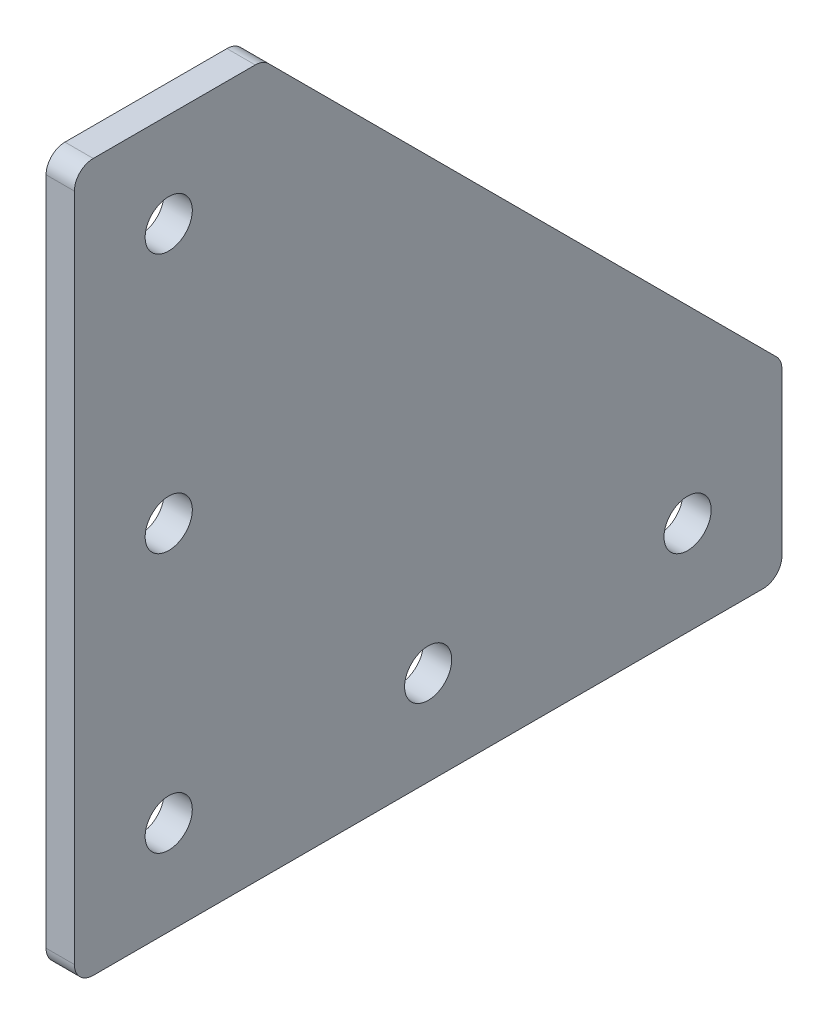
ISO-10303-21;
HEADER;
FILE_DESCRIPTION(('STEP AP214'),'2;1');
FILE_NAME('part.step','',(''),(''),'','','');
FILE_SCHEMA(('AUTOMOTIVE_DESIGN { 1 0 10303 214 1 1 1 1 }'));
ENDSEC;
DATA;
#1=APPLICATION_CONTEXT('core data for automotive mechanical design processes');
#2=APPLICATION_PROTOCOL_DEFINITION('international standard','automotive_design',2000,#1);
#3=PRODUCT_CONTEXT('',#1,'mechanical');
#4=PRODUCT('Part','Part','',(#3));
#5=PRODUCT_RELATED_PRODUCT_CATEGORY('part','',(#4));
#6=PRODUCT_DEFINITION_FORMATION('','',#4);
#7=PRODUCT_DEFINITION_CONTEXT('part definition',#1,'design');
#8=PRODUCT_DEFINITION('design','',#6,#7);
#9=PRODUCT_DEFINITION_SHAPE('','',#8);
#10=(LENGTH_UNIT() NAMED_UNIT(*) SI_UNIT(.MILLI.,.METRE.));
#11=(NAMED_UNIT(*) PLANE_ANGLE_UNIT() SI_UNIT($,.RADIAN.));
#12=(NAMED_UNIT(*) SI_UNIT($,.STERADIAN.) SOLID_ANGLE_UNIT());
#13=UNCERTAINTY_MEASURE_WITH_UNIT(LENGTH_MEASURE(1.E-05),#10,'distance_accuracy_value','');
#14=(GEOMETRIC_REPRESENTATION_CONTEXT(3) GLOBAL_UNCERTAINTY_ASSIGNED_CONTEXT((#13)) GLOBAL_UNIT_ASSIGNED_CONTEXT((#10,
#11,#12)) REPRESENTATION_CONTEXT('',''));
#15=CARTESIAN_POINT('',(0.,0.,0.));
#16=DIRECTION('',(0.,0.,1.));
#17=DIRECTION('',(1.,0.,0.));
#18=AXIS2_PLACEMENT_3D('',#15,#16,#17);
#19=CARTESIAN_POINT('',(3.,0.,0.));
#20=DIRECTION('',(-1.,0.,0.));
#21=DIRECTION('',(0.,0.,1.));
#22=AXIS2_PLACEMENT_3D('',#19,#20,#21);
#23=PLANE('',#22);
#24=DIRECTION('',(0.,-1.,0.));
#25=VECTOR('',#24,1.);
#26=CARTESIAN_POINT('',(3.,0.,0.));
#27=LINE('',#26,#25);
#28=CARTESIAN_POINT('',(3.,73.,0.));
#29=VERTEX_POINT('',#28);
#30=CARTESIAN_POINT('',(3.,2.,0.));
#31=VERTEX_POINT('',#30);
#32=EDGE_CURVE('E198',#29,#31,#27,.T.);
#33=ORIENTED_EDGE('',*,*,#32,.T.);
#34=CARTESIAN_POINT('',(3.,2.,-2.));
#35=DIRECTION('',(-1.,0.,0.));
#36=DIRECTION('',(0.,0.,1.));
#37=AXIS2_PLACEMENT_3D('',#34,#35,#36);
#38=CIRCLE('',#37,2.);
#39=CARTESIAN_POINT('',(3.,0.,-2.));
#40=VERTEX_POINT('',#39);
#41=EDGE_CURVE('E169',#31,#40,#38,.F.);
#42=ORIENTED_EDGE('',*,*,#41,.T.);
#43=DIRECTION('',(0.,0.,-1.));
#44=VECTOR('',#43,1.);
#45=CARTESIAN_POINT('',(3.,0.,-75.));
#46=LINE('',#45,#44);
#47=CARTESIAN_POINT('',(3.,0.,-73.));
#48=VERTEX_POINT('',#47);
#49=EDGE_CURVE('E135',#40,#48,#46,.T.);
#50=ORIENTED_EDGE('',*,*,#49,.T.);
#51=CARTESIAN_POINT('',(3.,2.00000000000001,-73.));
#52=DIRECTION('',(-1.,0.,0.));
#53=DIRECTION('',(0.,0.,1.));
#54=AXIS2_PLACEMENT_3D('',#51,#52,#53);
#55=CIRCLE('',#54,2.);
#56=CARTESIAN_POINT('',(3.,2.00000000000001,-75.));
#57=VERTEX_POINT('',#56);
#58=EDGE_CURVE('E167',#48,#57,#55,.F.);
#59=ORIENTED_EDGE('',*,*,#58,.T.);
#60=DIRECTION('',(0.,1.,0.));
#61=VECTOR('',#60,1.);
#62=CARTESIAN_POINT('',(3.,20.,-75.));
#63=LINE('',#62,#61);
#64=CARTESIAN_POINT('',(3.,19.1715728752538,-75.));
#65=VERTEX_POINT('',#64);
#66=EDGE_CURVE('E142',#57,#65,#63,.T.);
#67=ORIENTED_EDGE('',*,*,#66,.T.);
#68=CARTESIAN_POINT('',(3.,19.1715728752538,-73.));
#69=DIRECTION('',(-1.,0.,0.));
#70=DIRECTION('',(0.,0.,1.));
#71=AXIS2_PLACEMENT_3D('',#68,#69,#70);
#72=CIRCLE('',#71,2.);
#73=CARTESIAN_POINT('',(3.,20.585786437627,-74.4142135623731));
#74=VERTEX_POINT('',#73);
#75=EDGE_CURVE('E165',#65,#74,#72,.F.);
#76=ORIENTED_EDGE('',*,*,#75,.T.);
#77=DIRECTION('',(0.,0.707106781186547,0.707106781186548));
#78=VECTOR('',#77,1.);
#79=CARTESIAN_POINT('',(3.,75.,-20.));
#80=LINE('',#79,#78);
#81=CARTESIAN_POINT('',(3.,74.4142135623731,-20.5857864376269));
#82=VERTEX_POINT('',#81);
#83=EDGE_CURVE('E146',#74,#82,#80,.T.);
#84=ORIENTED_EDGE('',*,*,#83,.T.);
#85=CARTESIAN_POINT('',(3.,73.,-19.1715728752538));
#86=DIRECTION('',(-1.,0.,0.));
#87=DIRECTION('',(0.,0.,1.));
#88=AXIS2_PLACEMENT_3D('',#85,#86,#87);
#89=CIRCLE('',#88,2.);
#90=CARTESIAN_POINT('',(3.,75.,-19.1715728752538));
#91=VERTEX_POINT('',#90);
#92=EDGE_CURVE('E58',#82,#91,#89,.F.);
#93=ORIENTED_EDGE('',*,*,#92,.T.);
#94=DIRECTION('',(0.,0.,1.));
#95=VECTOR('',#94,1.);
#96=CARTESIAN_POINT('',(3.,75.,0.));
#97=LINE('',#96,#95);
#98=CARTESIAN_POINT('',(3.,75.,-2.));
#99=VERTEX_POINT('',#98);
#100=EDGE_CURVE('E201',#91,#99,#97,.T.);
#101=ORIENTED_EDGE('',*,*,#100,.T.);
#102=CARTESIAN_POINT('',(3.,73.,-2.));
#103=DIRECTION('',(-1.,0.,0.));
#104=DIRECTION('',(0.,0.,1.));
#105=AXIS2_PLACEMENT_3D('',#102,#103,#104);
#106=CIRCLE('',#105,2.);
#107=EDGE_CURVE('E162',#99,#29,#106,.F.);
#108=ORIENTED_EDGE('',*,*,#107,.T.);
#109=EDGE_LOOP('',(#33,#42,#50,#59,#67,#76,#84,#93,#101,#108));
#110=FACE_BOUND('',#109,.T.);
#111=CARTESIAN_POINT('',(3.,9.99999999999999,-65.));
#112=DIRECTION('',(1.,0.,0.));
#113=DIRECTION('',(0.,0.,-1.));
#114=AXIS2_PLACEMENT_3D('',#111,#112,#113);
#115=CIRCLE('',#114,2.5);
#116=CARTESIAN_POINT('',(3.,9.99999999999999,-67.5));
#117=VERTEX_POINT('',#116);
#118=EDGE_CURVE('E194',#117,#117,#115,.T.);
#119=ORIENTED_EDGE('',*,*,#118,.F.);
#120=EDGE_LOOP('',(#119));
#121=FACE_BOUND('',#120,.T.);
#122=CARTESIAN_POINT('',(3.,9.99999999999999,-37.5));
#123=DIRECTION('',(1.,0.,0.));
#124=DIRECTION('',(0.,0.,-1.));
#125=AXIS2_PLACEMENT_3D('',#122,#123,#124);
#126=CIRCLE('',#125,2.5);
#127=CARTESIAN_POINT('',(3.,9.99999999999999,-40.));
#128=VERTEX_POINT('',#127);
#129=EDGE_CURVE('E207',#128,#128,#126,.T.);
#130=ORIENTED_EDGE('',*,*,#129,.F.);
#131=EDGE_LOOP('',(#130));
#132=FACE_BOUND('',#131,.T.);
#133=CARTESIAN_POINT('',(3.,9.99999999999999,-9.99999999999999));
#134=DIRECTION('',(1.,0.,0.));
#135=DIRECTION('',(0.,0.,-1.));
#136=AXIS2_PLACEMENT_3D('',#133,#134,#135);
#137=CIRCLE('',#136,2.5);
#138=CARTESIAN_POINT('',(3.,9.99999999999999,-12.5));
#139=VERTEX_POINT('',#138);
#140=EDGE_CURVE('E213',#139,#139,#137,.T.);
#141=ORIENTED_EDGE('',*,*,#140,.F.);
#142=EDGE_LOOP('',(#141));
#143=FACE_BOUND('',#142,.T.);
#144=CARTESIAN_POINT('',(3.,65.,-9.99999999999995));
#145=DIRECTION('',(1.,0.,0.));
#146=DIRECTION('',(0.,0.,1.));
#147=AXIS2_PLACEMENT_3D('',#144,#145,#146);
#148=CIRCLE('',#147,2.5);
#149=CARTESIAN_POINT('',(3.,65.,-7.49999999999996));
#150=VERTEX_POINT('',#149);
#151=EDGE_CURVE('E219',#150,#150,#148,.T.);
#152=ORIENTED_EDGE('',*,*,#151,.F.);
#153=EDGE_LOOP('',(#152));
#154=FACE_BOUND('',#153,.T.);
#155=CARTESIAN_POINT('',(3.,37.5,-9.99999999999997));
#156=DIRECTION('',(1.,0.,0.));
#157=DIRECTION('',(0.,0.,1.));
#158=AXIS2_PLACEMENT_3D('',#155,#156,#157);
#159=CIRCLE('',#158,2.50000000000001);
#160=CARTESIAN_POINT('',(3.,37.5,-7.49999999999996));
#161=VERTEX_POINT('',#160);
#162=EDGE_CURVE('E225',#161,#161,#159,.T.);
#163=ORIENTED_EDGE('',*,*,#162,.F.);
#164=EDGE_LOOP('',(#163));
#165=FACE_BOUND('',#164,.T.);
#166=ADVANCED_FACE('F37',(#110,#121,#132,#143,#154,#165),#23,.F.);
#167=CARTESIAN_POINT('',(0.,0.,0.));
#168=DIRECTION('',(-1.,0.,0.));
#169=DIRECTION('',(0.,0.,1.));
#170=AXIS2_PLACEMENT_3D('',#167,#168,#169);
#171=PLANE('',#170);
#172=CARTESIAN_POINT('',(0.,65.,-9.99999999999995));
#173=DIRECTION('',(1.,0.,0.));
#174=DIRECTION('',(0.,0.,1.));
#175=AXIS2_PLACEMENT_3D('',#172,#173,#174);
#176=CIRCLE('',#175,2.5);
#177=CARTESIAN_POINT('',(0.,65.,-7.49999999999996));
#178=VERTEX_POINT('',#177);
#179=EDGE_CURVE('E222',#178,#178,#176,.T.);
#180=ORIENTED_EDGE('',*,*,#179,.T.);
#181=EDGE_LOOP('',(#180));
#182=FACE_BOUND('',#181,.T.);
#183=CARTESIAN_POINT('',(0.,9.99999999999999,-37.5));
#184=DIRECTION('',(1.,0.,0.));
#185=DIRECTION('',(0.,0.,-1.));
#186=AXIS2_PLACEMENT_3D('',#183,#184,#185);
#187=CIRCLE('',#186,2.5);
#188=CARTESIAN_POINT('',(0.,9.99999999999999,-40.));
#189=VERTEX_POINT('',#188);
#190=EDGE_CURVE('E210',#189,#189,#187,.T.);
#191=ORIENTED_EDGE('',*,*,#190,.T.);
#192=EDGE_LOOP('',(#191));
#193=FACE_BOUND('',#192,.T.);
#194=DIRECTION('',(0.,0.,-1.));
#195=VECTOR('',#194,1.);
#196=CARTESIAN_POINT('',(0.,0.,-75.));
#197=LINE('',#196,#195);
#198=CARTESIAN_POINT('',(0.,0.,-2.));
#199=VERTEX_POINT('',#198);
#200=CARTESIAN_POINT('',(0.,0.,-73.));
#201=VERTEX_POINT('',#200);
#202=EDGE_CURVE('E132',#199,#201,#197,.T.);
#203=ORIENTED_EDGE('',*,*,#202,.F.);
#204=CARTESIAN_POINT('',(0.,2.,-2.));
#205=DIRECTION('',(-1.,0.,0.));
#206=DIRECTION('',(0.,0.,1.));
#207=AXIS2_PLACEMENT_3D('',#204,#205,#206);
#208=CIRCLE('',#207,2.);
#209=CARTESIAN_POINT('',(0.,2.,0.));
#210=VERTEX_POINT('',#209);
#211=EDGE_CURVE('E115',#199,#210,#208,.T.);
#212=ORIENTED_EDGE('',*,*,#211,.T.);
#213=DIRECTION('',(0.,-1.,0.));
#214=VECTOR('',#213,1.);
#215=CARTESIAN_POINT('',(0.,0.,0.));
#216=LINE('',#215,#214);
#217=CARTESIAN_POINT('',(0.,73.,0.));
#218=VERTEX_POINT('',#217);
#219=EDGE_CURVE('E143',#218,#210,#216,.T.);
#220=ORIENTED_EDGE('',*,*,#219,.F.);
#221=CARTESIAN_POINT('',(0.,73.,-2.));
#222=DIRECTION('',(-1.,0.,0.));
#223=DIRECTION('',(0.,0.,1.));
#224=AXIS2_PLACEMENT_3D('',#221,#222,#223);
#225=CIRCLE('',#224,2.);
#226=CARTESIAN_POINT('',(0.,75.,-2.));
#227=VERTEX_POINT('',#226);
#228=EDGE_CURVE('E136',#218,#227,#225,.T.);
#229=ORIENTED_EDGE('',*,*,#228,.T.);
#230=DIRECTION('',(0.,0.,1.));
#231=VECTOR('',#230,1.);
#232=CARTESIAN_POINT('',(0.,75.,0.));
#233=LINE('',#232,#231);
#234=CARTESIAN_POINT('',(0.,75.,-19.1715728752538));
#235=VERTEX_POINT('',#234);
#236=EDGE_CURVE('E148',#235,#227,#233,.T.);
#237=ORIENTED_EDGE('',*,*,#236,.F.);
#238=CARTESIAN_POINT('',(0.,73.,-19.1715728752538));
#239=DIRECTION('',(-1.,0.,0.));
#240=DIRECTION('',(0.,0.,1.));
#241=AXIS2_PLACEMENT_3D('',#238,#239,#240);
#242=CIRCLE('',#241,2.);
#243=CARTESIAN_POINT('',(0.,74.4142135623731,-20.5857864376269));
#244=VERTEX_POINT('',#243);
#245=EDGE_CURVE('E154',#235,#244,#242,.T.);
#246=ORIENTED_EDGE('',*,*,#245,.T.);
#247=DIRECTION('',(0.,0.707106781186547,0.707106781186548));
#248=VECTOR('',#247,1.);
#249=CARTESIAN_POINT('',(0.,75.,-20.));
#250=LINE('',#249,#248);
#251=CARTESIAN_POINT('',(0.,20.585786437627,-74.4142135623731));
#252=VERTEX_POINT('',#251);
#253=EDGE_CURVE('E186',#252,#244,#250,.T.);
#254=ORIENTED_EDGE('',*,*,#253,.F.);
#255=CARTESIAN_POINT('',(0.,19.1715728752538,-73.));
#256=DIRECTION('',(-1.,0.,0.));
#257=DIRECTION('',(0.,0.,1.));
#258=AXIS2_PLACEMENT_3D('',#255,#256,#257);
#259=CIRCLE('',#258,2.);
#260=CARTESIAN_POINT('',(0.,19.1715728752538,-75.));
#261=VERTEX_POINT('',#260);
#262=EDGE_CURVE('E156',#252,#261,#259,.T.);
#263=ORIENTED_EDGE('',*,*,#262,.T.);
#264=DIRECTION('',(0.,1.,0.));
#265=VECTOR('',#264,1.);
#266=CARTESIAN_POINT('',(0.,20.,-75.));
#267=LINE('',#266,#265);
#268=CARTESIAN_POINT('',(0.,2.00000000000001,-75.));
#269=VERTEX_POINT('',#268);
#270=EDGE_CURVE('E192',#269,#261,#267,.T.);
#271=ORIENTED_EDGE('',*,*,#270,.F.);
#272=CARTESIAN_POINT('',(0.,2.00000000000001,-73.));
#273=DIRECTION('',(-1.,0.,0.));
#274=DIRECTION('',(0.,0.,1.));
#275=AXIS2_PLACEMENT_3D('',#272,#273,#274);
#276=CIRCLE('',#275,2.);
#277=EDGE_CURVE('E126',#269,#201,#276,.T.);
#278=ORIENTED_EDGE('',*,*,#277,.T.);
#279=EDGE_LOOP('',(#203,#212,#220,#229,#237,#246,#254,#263,#271,#278));
#280=FACE_BOUND('',#279,.T.);
#281=CARTESIAN_POINT('',(0.,9.99999999999999,-65.));
#282=DIRECTION('',(1.,0.,0.));
#283=DIRECTION('',(0.,0.,-1.));
#284=AXIS2_PLACEMENT_3D('',#281,#282,#283);
#285=CIRCLE('',#284,2.5);
#286=CARTESIAN_POINT('',(0.,9.99999999999999,-67.5));
#287=VERTEX_POINT('',#286);
#288=EDGE_CURVE('E204',#287,#287,#285,.T.);
#289=ORIENTED_EDGE('',*,*,#288,.T.);
#290=EDGE_LOOP('',(#289));
#291=FACE_BOUND('',#290,.T.);
#292=CARTESIAN_POINT('',(0.,9.99999999999999,-9.99999999999999));
#293=DIRECTION('',(1.,0.,0.));
#294=DIRECTION('',(0.,0.,-1.));
#295=AXIS2_PLACEMENT_3D('',#292,#293,#294);
#296=CIRCLE('',#295,2.5);
#297=CARTESIAN_POINT('',(0.,9.99999999999999,-12.5));
#298=VERTEX_POINT('',#297);
#299=EDGE_CURVE('E216',#298,#298,#296,.T.);
#300=ORIENTED_EDGE('',*,*,#299,.T.);
#301=EDGE_LOOP('',(#300));
#302=FACE_BOUND('',#301,.T.);
#303=CARTESIAN_POINT('',(0.,37.5,-9.99999999999997));
#304=DIRECTION('',(1.,0.,0.));
#305=DIRECTION('',(0.,0.,1.));
#306=AXIS2_PLACEMENT_3D('',#303,#304,#305);
#307=CIRCLE('',#306,2.50000000000001);
#308=CARTESIAN_POINT('',(0.,37.5,-7.49999999999996));
#309=VERTEX_POINT('',#308);
#310=EDGE_CURVE('E228',#309,#309,#307,.T.);
#311=ORIENTED_EDGE('',*,*,#310,.T.);
#312=EDGE_LOOP('',(#311));
#313=FACE_BOUND('',#312,.T.);
#314=ADVANCED_FACE('F139',(#182,#193,#280,#291,#302,#313),#171,.T.);
#315=CARTESIAN_POINT('',(3.,20.,-75.));
#316=DIRECTION('',(0.,0.,1.));
#317=DIRECTION('',(1.,0.,0.));
#318=AXIS2_PLACEMENT_3D('',#315,#316,#317);
#319=PLANE('',#318);
#320=ORIENTED_EDGE('',*,*,#66,.F.);
#321=DIRECTION('',(-1.,0.,0.));
#322=VECTOR('',#321,1.);
#323=CARTESIAN_POINT('',(3.,2.00000000000001,-75.));
#324=LINE('',#323,#322);
#325=EDGE_CURVE('E173',#57,#269,#324,.T.);
#326=ORIENTED_EDGE('',*,*,#325,.T.);
#327=ORIENTED_EDGE('',*,*,#270,.T.);
#328=DIRECTION('',(-1.,0.,0.));
#329=VECTOR('',#328,1.);
#330=CARTESIAN_POINT('',(3.,19.1715728752538,-75.));
#331=LINE('',#330,#329);
#332=EDGE_CURVE('E171',#261,#65,#331,.F.);
#333=ORIENTED_EDGE('',*,*,#332,.T.);
#334=EDGE_LOOP('',(#320,#326,#327,#333));
#335=FACE_BOUND('',#334,.T.);
#336=ADVANCED_FACE('F242',(#335),#319,.F.);
#337=CARTESIAN_POINT('',(3.,75.,-20.));
#338=DIRECTION('',(0.,-0.707106781186548,0.707106781186547));
#339=DIRECTION('',(0.,-0.707106781186547,-0.707106781186548));
#340=AXIS2_PLACEMENT_3D('',#337,#338,#339);
#341=PLANE('',#340);
#342=ORIENTED_EDGE('',*,*,#83,.F.);
#343=DIRECTION('',(-1.,0.,0.));
#344=VECTOR('',#343,1.);
#345=CARTESIAN_POINT('',(3.,20.5857864376269,-74.4142135623731));
#346=LINE('',#345,#344);
#347=EDGE_CURVE('E178',#74,#252,#346,.T.);
#348=ORIENTED_EDGE('',*,*,#347,.T.);
#349=ORIENTED_EDGE('',*,*,#253,.T.);
#350=DIRECTION('',(-1.,0.,0.));
#351=VECTOR('',#350,1.);
#352=CARTESIAN_POINT('',(3.,74.4142135623731,-20.5857864376269));
#353=LINE('',#352,#351);
#354=EDGE_CURVE('E176',#244,#82,#353,.F.);
#355=ORIENTED_EDGE('',*,*,#354,.T.);
#356=EDGE_LOOP('',(#342,#348,#349,#355));
#357=FACE_BOUND('',#356,.T.);
#358=ADVANCED_FACE('F185',(#357),#341,.F.);
#359=CARTESIAN_POINT('',(3.,75.,0.));
#360=DIRECTION('',(0.,-1.,0.));
#361=DIRECTION('',(0.,0.,-1.));
#362=AXIS2_PLACEMENT_3D('',#359,#360,#361);
#363=PLANE('',#362);
#364=ORIENTED_EDGE('',*,*,#100,.F.);
#365=DIRECTION('',(-1.,0.,0.));
#366=VECTOR('',#365,1.);
#367=CARTESIAN_POINT('',(3.,75.,-19.1715728752538));
#368=LINE('',#367,#366);
#369=EDGE_CURVE('E11',#91,#235,#368,.T.);
#370=ORIENTED_EDGE('',*,*,#369,.T.);
#371=ORIENTED_EDGE('',*,*,#236,.T.);
#372=DIRECTION('',(-1.,0.,0.));
#373=VECTOR('',#372,1.);
#374=CARTESIAN_POINT('',(3.,75.,-2.));
#375=LINE('',#374,#373);
#376=EDGE_CURVE('E45',#227,#99,#375,.F.);
#377=ORIENTED_EDGE('',*,*,#376,.T.);
#378=EDGE_LOOP('',(#364,#370,#371,#377));
#379=FACE_BOUND('',#378,.T.);
#380=ADVANCED_FACE('F255',(#379),#363,.F.);
#381=CARTESIAN_POINT('',(3.,0.,0.));
#382=DIRECTION('',(0.,0.,-1.));
#383=DIRECTION('',(-1.,0.,0.));
#384=AXIS2_PLACEMENT_3D('',#381,#382,#383);
#385=PLANE('',#384);
#386=ORIENTED_EDGE('',*,*,#219,.T.);
#387=DIRECTION('',(-1.,0.,0.));
#388=VECTOR('',#387,1.);
#389=CARTESIAN_POINT('',(3.,2.,0.));
#390=LINE('',#389,#388);
#391=EDGE_CURVE('E120',#210,#31,#390,.F.);
#392=ORIENTED_EDGE('',*,*,#391,.T.);
#393=ORIENTED_EDGE('',*,*,#32,.F.);
#394=DIRECTION('',(-1.,0.,0.));
#395=VECTOR('',#394,1.);
#396=CARTESIAN_POINT('',(3.,73.,0.));
#397=LINE('',#396,#395);
#398=EDGE_CURVE('E125',#29,#218,#397,.T.);
#399=ORIENTED_EDGE('',*,*,#398,.T.);
#400=EDGE_LOOP('',(#386,#392,#393,#399));
#401=FACE_BOUND('',#400,.T.);
#402=ADVANCED_FACE('F252',(#401),#385,.F.);
#403=CARTESIAN_POINT('',(3.,0.,-75.));
#404=DIRECTION('',(0.,1.,0.));
#405=DIRECTION('',(0.,0.,1.));
#406=AXIS2_PLACEMENT_3D('',#403,#404,#405);
#407=PLANE('',#406);
#408=ORIENTED_EDGE('',*,*,#49,.F.);
#409=DIRECTION('',(-1.,0.,0.));
#410=VECTOR('',#409,1.);
#411=CARTESIAN_POINT('',(3.,0.,-2.));
#412=LINE('',#411,#410);
#413=EDGE_CURVE('E119',#40,#199,#412,.T.);
#414=ORIENTED_EDGE('',*,*,#413,.T.);
#415=ORIENTED_EDGE('',*,*,#202,.T.);
#416=DIRECTION('',(-1.,0.,0.));
#417=VECTOR('',#416,1.);
#418=CARTESIAN_POINT('',(3.,0.,-73.));
#419=LINE('',#418,#417);
#420=EDGE_CURVE('E137',#201,#48,#419,.F.);
#421=ORIENTED_EDGE('',*,*,#420,.T.);
#422=EDGE_LOOP('',(#408,#414,#415,#421));
#423=FACE_BOUND('',#422,.T.);
#424=ADVANCED_FACE('F131',(#423),#407,.F.);
#425=CARTESIAN_POINT('',(3.,9.99999999999999,-65.));
#426=DIRECTION('',(-1.,0.,0.));
#427=DIRECTION('',(0.,0.,1.));
#428=AXIS2_PLACEMENT_3D('',#425,#426,#427);
#429=CYLINDRICAL_SURFACE('',#428,2.5);
#430=ORIENTED_EDGE('',*,*,#118,.T.);
#431=EDGE_LOOP('',(#430));
#432=FACE_BOUND('',#431,.T.);
#433=ORIENTED_EDGE('',*,*,#288,.F.);
#434=EDGE_LOOP('',(#433));
#435=FACE_BOUND('',#434,.T.);
#436=ADVANCED_FACE('F247',(#432,#435),#429,.F.);
#437=CARTESIAN_POINT('',(3.,9.99999999999999,-37.5));
#438=DIRECTION('',(-1.,0.,0.));
#439=DIRECTION('',(0.,0.,1.));
#440=AXIS2_PLACEMENT_3D('',#437,#438,#439);
#441=CYLINDRICAL_SURFACE('',#440,2.5);
#442=ORIENTED_EDGE('',*,*,#129,.T.);
#443=EDGE_LOOP('',(#442));
#444=FACE_BOUND('',#443,.T.);
#445=ORIENTED_EDGE('',*,*,#190,.F.);
#446=EDGE_LOOP('',(#445));
#447=FACE_BOUND('',#446,.T.);
#448=ADVANCED_FACE('F381',(#444,#447),#441,.F.);
#449=CARTESIAN_POINT('',(3.,9.99999999999999,-9.99999999999999));
#450=DIRECTION('',(-1.,0.,0.));
#451=DIRECTION('',(0.,0.,1.));
#452=AXIS2_PLACEMENT_3D('',#449,#450,#451);
#453=CYLINDRICAL_SURFACE('',#452,2.5);
#454=ORIENTED_EDGE('',*,*,#140,.T.);
#455=EDGE_LOOP('',(#454));
#456=FACE_BOUND('',#455,.T.);
#457=ORIENTED_EDGE('',*,*,#299,.F.);
#458=EDGE_LOOP('',(#457));
#459=FACE_BOUND('',#458,.T.);
#460=ADVANCED_FACE('F371',(#456,#459),#453,.F.);
#461=CARTESIAN_POINT('',(3.,65.,-9.99999999999995));
#462=DIRECTION('',(-1.,0.,0.));
#463=DIRECTION('',(0.,0.,1.));
#464=AXIS2_PLACEMENT_3D('',#461,#462,#463);
#465=CYLINDRICAL_SURFACE('',#464,2.5);
#466=ORIENTED_EDGE('',*,*,#151,.T.);
#467=EDGE_LOOP('',(#466));
#468=FACE_BOUND('',#467,.T.);
#469=ORIENTED_EDGE('',*,*,#179,.F.);
#470=EDGE_LOOP('',(#469));
#471=FACE_BOUND('',#470,.T.);
#472=ADVANCED_FACE('F362',(#468,#471),#465,.F.);
#473=CARTESIAN_POINT('',(3.,37.5,-9.99999999999997));
#474=DIRECTION('',(-1.,0.,0.));
#475=DIRECTION('',(0.,0.,1.));
#476=AXIS2_PLACEMENT_3D('',#473,#474,#475);
#477=CYLINDRICAL_SURFACE('',#476,2.50000000000001);
#478=ORIENTED_EDGE('',*,*,#162,.T.);
#479=EDGE_LOOP('',(#478));
#480=FACE_BOUND('',#479,.T.);
#481=ORIENTED_EDGE('',*,*,#310,.F.);
#482=EDGE_LOOP('',(#481));
#483=FACE_BOUND('',#482,.T.);
#484=ADVANCED_FACE('F234',(#480,#483),#477,.F.);
#485=CARTESIAN_POINT('',(3.,2.,-2.));
#486=DIRECTION('',(-1.,0.,0.));
#487=DIRECTION('',(0.,0.,1.));
#488=AXIS2_PLACEMENT_3D('',#485,#486,#487);
#489=CYLINDRICAL_SURFACE('',#488,2.);
#490=ORIENTED_EDGE('',*,*,#41,.F.);
#491=ORIENTED_EDGE('',*,*,#391,.F.);
#492=ORIENTED_EDGE('',*,*,#211,.F.);
#493=ORIENTED_EDGE('',*,*,#413,.F.);
#494=EDGE_LOOP('',(#490,#491,#492,#493));
#495=FACE_BOUND('',#494,.T.);
#496=ADVANCED_FACE('F118',(#495),#489,.T.);
#497=CARTESIAN_POINT('',(3.,2.00000000000001,-73.));
#498=DIRECTION('',(-1.,0.,0.));
#499=DIRECTION('',(0.,0.,1.));
#500=AXIS2_PLACEMENT_3D('',#497,#498,#499);
#501=CYLINDRICAL_SURFACE('',#500,2.);
#502=ORIENTED_EDGE('',*,*,#58,.F.);
#503=ORIENTED_EDGE('',*,*,#420,.F.);
#504=ORIENTED_EDGE('',*,*,#277,.F.);
#505=ORIENTED_EDGE('',*,*,#325,.F.);
#506=EDGE_LOOP('',(#502,#503,#504,#505));
#507=FACE_BOUND('',#506,.T.);
#508=ADVANCED_FACE('F266',(#507),#501,.T.);
#509=CARTESIAN_POINT('',(3.,19.1715728752538,-73.));
#510=DIRECTION('',(-1.,0.,0.));
#511=DIRECTION('',(0.,0.,1.));
#512=AXIS2_PLACEMENT_3D('',#509,#510,#511);
#513=CYLINDRICAL_SURFACE('',#512,2.);
#514=ORIENTED_EDGE('',*,*,#75,.F.);
#515=ORIENTED_EDGE('',*,*,#332,.F.);
#516=ORIENTED_EDGE('',*,*,#262,.F.);
#517=ORIENTED_EDGE('',*,*,#347,.F.);
#518=EDGE_LOOP('',(#514,#515,#516,#517));
#519=FACE_BOUND('',#518,.T.);
#520=ADVANCED_FACE('F269',(#519),#513,.T.);
#521=CARTESIAN_POINT('',(3.,73.,-19.1715728752538));
#522=DIRECTION('',(-1.,0.,0.));
#523=DIRECTION('',(0.,0.,1.));
#524=AXIS2_PLACEMENT_3D('',#521,#522,#523);
#525=CYLINDRICAL_SURFACE('',#524,2.);
#526=ORIENTED_EDGE('',*,*,#92,.F.);
#527=ORIENTED_EDGE('',*,*,#354,.F.);
#528=ORIENTED_EDGE('',*,*,#245,.F.);
#529=ORIENTED_EDGE('',*,*,#369,.F.);
#530=EDGE_LOOP('',(#526,#527,#528,#529));
#531=FACE_BOUND('',#530,.T.);
#532=ADVANCED_FACE('F272',(#531),#525,.T.);
#533=CARTESIAN_POINT('',(3.,73.,-2.));
#534=DIRECTION('',(-1.,0.,0.));
#535=DIRECTION('',(0.,0.,1.));
#536=AXIS2_PLACEMENT_3D('',#533,#534,#535);
#537=CYLINDRICAL_SURFACE('',#536,2.);
#538=ORIENTED_EDGE('',*,*,#107,.F.);
#539=ORIENTED_EDGE('',*,*,#376,.F.);
#540=ORIENTED_EDGE('',*,*,#228,.F.);
#541=ORIENTED_EDGE('',*,*,#398,.F.);
#542=EDGE_LOOP('',(#538,#539,#540,#541));
#543=FACE_BOUND('',#542,.T.);
#544=ADVANCED_FACE('F39',(#543),#537,.T.);
#545=CLOSED_SHELL('',(#166,#314,#336,#358,#380,#402,#424,#436,#448,#460,#472,#484,#496,#508,
#520,#532,#544));
#546=MANIFOLD_SOLID_BREP('B2',#545);
#547=ADVANCED_BREP_SHAPE_REPRESENTATION('',(#18,#546),#14);
#548=SHAPE_DEFINITION_REPRESENTATION(#9,#547);
ENDSEC;
END-ISO-10303-21;
